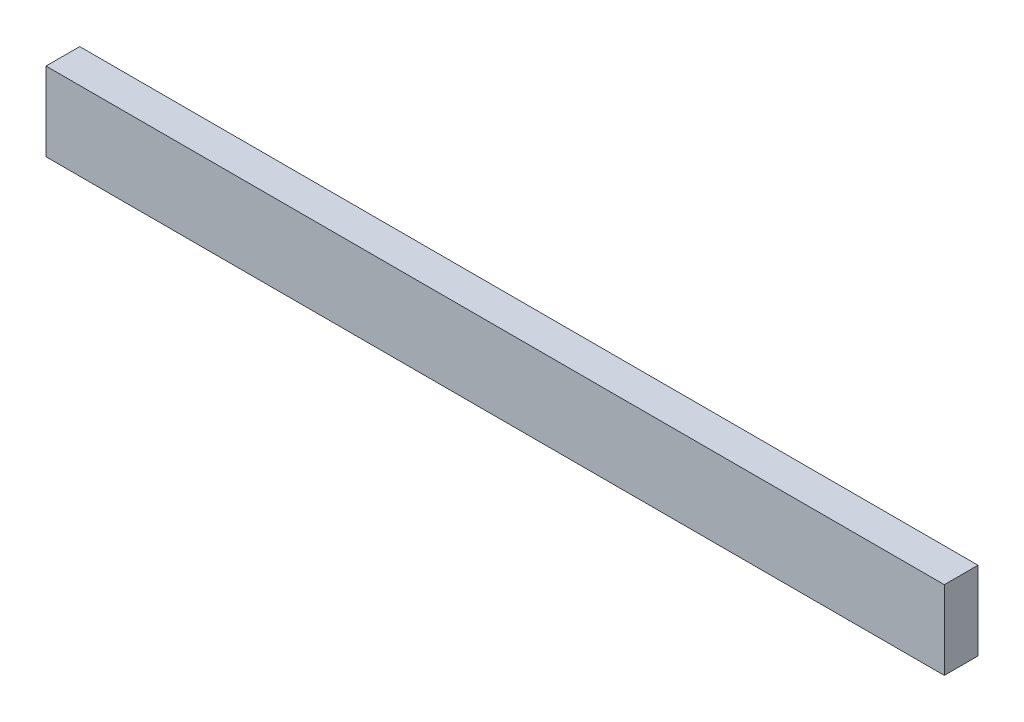
ISO-10303-21;
HEADER;
FILE_DESCRIPTION(('STEP AP214'),'2;1');
FILE_NAME('part.step','',(''),(''),'','','');
FILE_SCHEMA(('AUTOMOTIVE_DESIGN { 1 0 10303 214 1 1 1 1 }'));
ENDSEC;
DATA;
#1=APPLICATION_CONTEXT('core data for automotive mechanical design processes');
#2=APPLICATION_PROTOCOL_DEFINITION('international standard','automotive_design',2000,#1);
#3=PRODUCT_CONTEXT('',#1,'mechanical');
#4=PRODUCT('Part','Part','',(#3));
#5=PRODUCT_RELATED_PRODUCT_CATEGORY('part','',(#4));
#6=PRODUCT_DEFINITION_FORMATION('','',#4);
#7=PRODUCT_DEFINITION_CONTEXT('part definition',#1,'design');
#8=PRODUCT_DEFINITION('design','',#6,#7);
#9=PRODUCT_DEFINITION_SHAPE('','',#8);
#10=(LENGTH_UNIT() NAMED_UNIT(*) SI_UNIT(.MILLI.,.METRE.));
#11=(NAMED_UNIT(*) PLANE_ANGLE_UNIT() SI_UNIT($,.RADIAN.));
#12=(NAMED_UNIT(*) SI_UNIT($,.STERADIAN.) SOLID_ANGLE_UNIT());
#13=UNCERTAINTY_MEASURE_WITH_UNIT(LENGTH_MEASURE(1.E-05),#10,'distance_accuracy_value','');
#14=(GEOMETRIC_REPRESENTATION_CONTEXT(3) GLOBAL_UNCERTAINTY_ASSIGNED_CONTEXT((#13)) GLOBAL_UNIT_ASSIGNED_CONTEXT((#10,
#11,#12)) REPRESENTATION_CONTEXT('',''));
#15=CARTESIAN_POINT('',(0.,0.,0.));
#16=DIRECTION('',(0.,0.,1.));
#17=DIRECTION('',(1.,0.,0.));
#18=AXIS2_PLACEMENT_3D('',#15,#16,#17);
#19=CARTESIAN_POINT('',(-508.,-88.9,-575.46875));
#20=DIRECTION('',(1.,0.,0.));
#21=DIRECTION('',(0.,0.,-1.));
#22=AXIS2_PLACEMENT_3D('',#19,#20,#21);
#23=PLANE('',#22);
#24=DIRECTION('',(0.,0.,-1.));
#25=VECTOR('',#24,1.);
#26=CARTESIAN_POINT('',(-508.,0.,-575.46875));
#27=LINE('',#26,#25);
#28=CARTESIAN_POINT('',(-508.,0.,-575.46875));
#29=VERTEX_POINT('',#28);
#30=CARTESIAN_POINT('',(-508.,0.,-613.56875));
#31=VERTEX_POINT('',#30);
#32=EDGE_CURVE('E99',#29,#31,#27,.T.);
#33=ORIENTED_EDGE('',*,*,#32,.T.);
#34=DIRECTION('',(0.,1.,0.));
#35=VECTOR('',#34,1.);
#36=CARTESIAN_POINT('',(-508.,-88.9,-613.56875));
#37=LINE('',#36,#35);
#38=CARTESIAN_POINT('',(-508.,-88.9,-613.56875));
#39=VERTEX_POINT('',#38);
#40=EDGE_CURVE('E11',#39,#31,#37,.T.);
#41=ORIENTED_EDGE('',*,*,#40,.F.);
#42=DIRECTION('',(0.,0.,-1.));
#43=VECTOR('',#42,1.);
#44=CARTESIAN_POINT('',(-508.,-88.9,-575.46875));
#45=LINE('',#44,#43);
#46=CARTESIAN_POINT('',(-508.,-88.9,-575.46875));
#47=VERTEX_POINT('',#46);
#48=EDGE_CURVE('E87',#47,#39,#45,.T.);
#49=ORIENTED_EDGE('',*,*,#48,.F.);
#50=DIRECTION('',(0.,1.,0.));
#51=VECTOR('',#50,1.);
#52=CARTESIAN_POINT('',(-508.,-88.9,-575.46875));
#53=LINE('',#52,#51);
#54=EDGE_CURVE('E95',#47,#29,#53,.T.);
#55=ORIENTED_EDGE('',*,*,#54,.T.);
#56=EDGE_LOOP('',(#33,#41,#49,#55));
#57=FACE_BOUND('',#56,.T.);
#58=ADVANCED_FACE('F36',(#57),#23,.F.);
#59=CARTESIAN_POINT('',(-508.,-88.9,-613.56875));
#60=DIRECTION('',(0.,0.,1.));
#61=DIRECTION('',(1.,0.,0.));
#62=AXIS2_PLACEMENT_3D('',#59,#60,#61);
#63=PLANE('',#62);
#64=DIRECTION('',(1.,0.,0.));
#65=VECTOR('',#64,1.);
#66=CARTESIAN_POINT('',(-508.,0.,-613.56875));
#67=LINE('',#66,#65);
#68=CARTESIAN_POINT('',(508.,0.,-613.56875));
#69=VERTEX_POINT('',#68);
#70=EDGE_CURVE('E91',#31,#69,#67,.T.);
#71=ORIENTED_EDGE('',*,*,#70,.T.);
#72=DIRECTION('',(0.,1.,0.));
#73=VECTOR('',#72,1.);
#74=CARTESIAN_POINT('',(508.,-88.9,-613.56875));
#75=LINE('',#74,#73);
#76=CARTESIAN_POINT('',(508.,-88.9,-613.56875));
#77=VERTEX_POINT('',#76);
#78=EDGE_CURVE('E44',#77,#69,#75,.T.);
#79=ORIENTED_EDGE('',*,*,#78,.F.);
#80=DIRECTION('',(1.,0.,0.));
#81=VECTOR('',#80,1.);
#82=CARTESIAN_POINT('',(-508.,-88.9,-613.56875));
#83=LINE('',#82,#81);
#84=EDGE_CURVE('E82',#39,#77,#83,.T.);
#85=ORIENTED_EDGE('',*,*,#84,.F.);
#86=ORIENTED_EDGE('',*,*,#40,.T.);
#87=EDGE_LOOP('',(#71,#79,#85,#86));
#88=FACE_BOUND('',#87,.T.);
#89=ADVANCED_FACE('F90',(#88),#63,.F.);
#90=CARTESIAN_POINT('',(508.,-88.9,-575.46875));
#91=DIRECTION('',(-1.,0.,0.));
#92=DIRECTION('',(0.,0.,1.));
#93=AXIS2_PLACEMENT_3D('',#90,#91,#92);
#94=PLANE('',#93);
#95=DIRECTION('',(0.,0.,1.));
#96=VECTOR('',#95,1.);
#97=CARTESIAN_POINT('',(508.,0.,-575.46875));
#98=LINE('',#97,#96);
#99=CARTESIAN_POINT('',(508.,0.,-575.46875));
#100=VERTEX_POINT('',#99);
#101=EDGE_CURVE('E69',#69,#100,#98,.T.);
#102=ORIENTED_EDGE('',*,*,#101,.T.);
#103=DIRECTION('',(0.,1.,0.));
#104=VECTOR('',#103,1.);
#105=CARTESIAN_POINT('',(508.,-88.9,-575.46875));
#106=LINE('',#105,#104);
#107=CARTESIAN_POINT('',(508.,-88.9,-575.46875));
#108=VERTEX_POINT('',#107);
#109=EDGE_CURVE('E92',#108,#100,#106,.T.);
#110=ORIENTED_EDGE('',*,*,#109,.F.);
#111=DIRECTION('',(0.,0.,1.));
#112=VECTOR('',#111,1.);
#113=CARTESIAN_POINT('',(508.,-88.9,-575.46875));
#114=LINE('',#113,#112);
#115=EDGE_CURVE('E85',#77,#108,#114,.T.);
#116=ORIENTED_EDGE('',*,*,#115,.F.);
#117=ORIENTED_EDGE('',*,*,#78,.T.);
#118=EDGE_LOOP('',(#102,#110,#116,#117));
#119=FACE_BOUND('',#118,.T.);
#120=ADVANCED_FACE('F93',(#119),#94,.F.);
#121=CARTESIAN_POINT('',(-508.,-88.9,-575.46875));
#122=DIRECTION('',(0.,0.,-1.));
#123=DIRECTION('',(-1.,0.,0.));
#124=AXIS2_PLACEMENT_3D('',#121,#122,#123);
#125=PLANE('',#124);
#126=DIRECTION('',(-1.,0.,0.));
#127=VECTOR('',#126,1.);
#128=CARTESIAN_POINT('',(-508.,0.,-575.46875));
#129=LINE('',#128,#127);
#130=EDGE_CURVE('E75',#100,#29,#129,.T.);
#131=ORIENTED_EDGE('',*,*,#130,.T.);
#132=ORIENTED_EDGE('',*,*,#54,.F.);
#133=DIRECTION('',(-1.,0.,0.));
#134=VECTOR('',#133,1.);
#135=CARTESIAN_POINT('',(-508.,-88.9,-575.46875));
#136=LINE('',#135,#134);
#137=EDGE_CURVE('E52',#108,#47,#136,.T.);
#138=ORIENTED_EDGE('',*,*,#137,.F.);
#139=ORIENTED_EDGE('',*,*,#109,.T.);
#140=EDGE_LOOP('',(#131,#132,#138,#139));
#141=FACE_BOUND('',#140,.T.);
#142=ADVANCED_FACE('F106',(#141),#125,.F.);
#143=CARTESIAN_POINT('',(0.,-88.9,0.));
#144=DIRECTION('',(0.,-1.,0.));
#145=DIRECTION('',(0.,0.,-1.));
#146=AXIS2_PLACEMENT_3D('',#143,#144,#145);
#147=PLANE('',#146);
#148=ORIENTED_EDGE('',*,*,#48,.T.);
#149=ORIENTED_EDGE('',*,*,#84,.T.);
#150=ORIENTED_EDGE('',*,*,#115,.T.);
#151=ORIENTED_EDGE('',*,*,#137,.T.);
#152=EDGE_LOOP('',(#148,#149,#150,#151));
#153=FACE_BOUND('',#152,.T.);
#154=ADVANCED_FACE('F83',(#153),#147,.T.);
#155=CARTESIAN_POINT('',(0.,0.,0.));
#156=DIRECTION('',(0.,-1.,0.));
#157=DIRECTION('',(0.,0.,-1.));
#158=AXIS2_PLACEMENT_3D('',#155,#156,#157);
#159=PLANE('',#158);
#160=ORIENTED_EDGE('',*,*,#32,.F.);
#161=ORIENTED_EDGE('',*,*,#130,.F.);
#162=ORIENTED_EDGE('',*,*,#101,.F.);
#163=ORIENTED_EDGE('',*,*,#70,.F.);
#164=EDGE_LOOP('',(#160,#161,#162,#163));
#165=FACE_BOUND('',#164,.T.);
#166=ADVANCED_FACE('F109',(#165),#159,.F.);
#167=CLOSED_SHELL('',(#58,#89,#120,#142,#154,#166));
#168=MANIFOLD_SOLID_BREP('B2',#167);
#169=ADVANCED_BREP_SHAPE_REPRESENTATION('',(#18,#168),#14);
#170=SHAPE_DEFINITION_REPRESENTATION(#9,#169);
ENDSEC;
END-ISO-10303-21;
